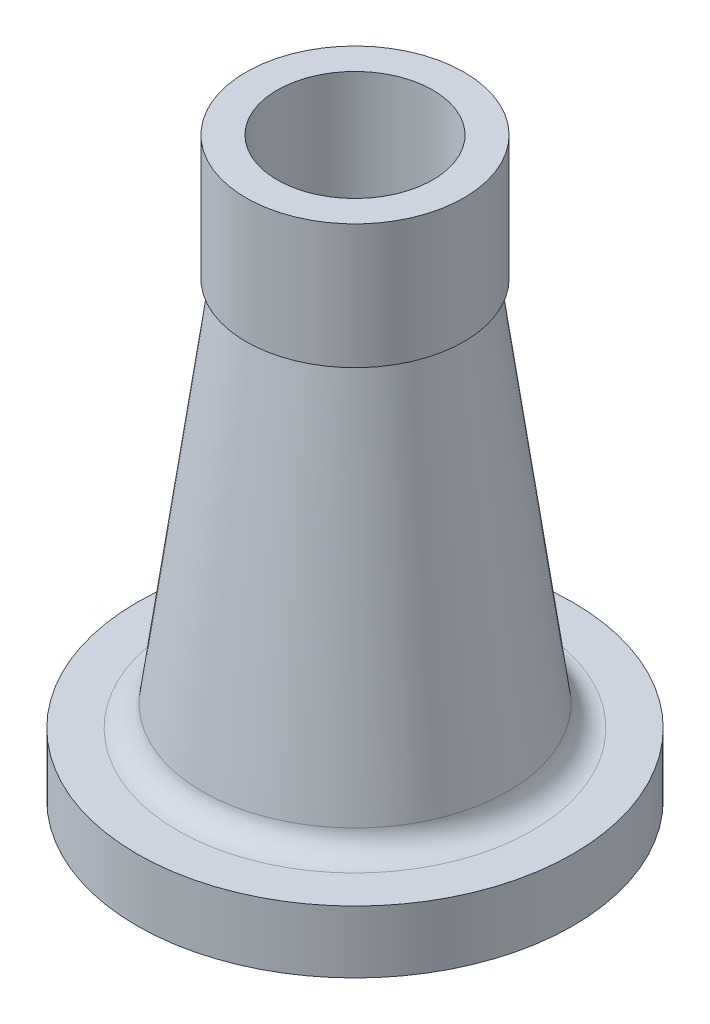
ISO-10303-21;
HEADER;
FILE_DESCRIPTION(('STEP AP214'),'2;1');
FILE_NAME('part.step','',(''),(''),'','','');
FILE_SCHEMA(('AUTOMOTIVE_DESIGN { 1 0 10303 214 1 1 1 1 }'));
ENDSEC;
DATA;
#1=APPLICATION_CONTEXT('core data for automotive mechanical design processes');
#2=APPLICATION_PROTOCOL_DEFINITION('international standard','automotive_design',2000,#1);
#3=PRODUCT_CONTEXT('',#1,'mechanical');
#4=PRODUCT('Part','Part','',(#3));
#5=PRODUCT_RELATED_PRODUCT_CATEGORY('part','',(#4));
#6=PRODUCT_DEFINITION_FORMATION('','',#4);
#7=PRODUCT_DEFINITION_CONTEXT('part definition',#1,'design');
#8=PRODUCT_DEFINITION('design','',#6,#7);
#9=PRODUCT_DEFINITION_SHAPE('','',#8);
#10=(LENGTH_UNIT() NAMED_UNIT(*) SI_UNIT(.MILLI.,.METRE.));
#11=(NAMED_UNIT(*) PLANE_ANGLE_UNIT() SI_UNIT($,.RADIAN.));
#12=(NAMED_UNIT(*) SI_UNIT($,.STERADIAN.) SOLID_ANGLE_UNIT());
#13=UNCERTAINTY_MEASURE_WITH_UNIT(LENGTH_MEASURE(1.E-05),#10,'distance_accuracy_value','');
#14=(GEOMETRIC_REPRESENTATION_CONTEXT(3) GLOBAL_UNCERTAINTY_ASSIGNED_CONTEXT((#13)) GLOBAL_UNIT_ASSIGNED_CONTEXT((#10,
#11,#12)) REPRESENTATION_CONTEXT('',''));
#15=CARTESIAN_POINT('',(0.,0.,0.));
#16=DIRECTION('',(0.,0.,1.));
#17=DIRECTION('',(1.,0.,0.));
#18=AXIS2_PLACEMENT_3D('',#15,#16,#17);
#19=CARTESIAN_POINT('',(0.,0.,0.));
#20=DIRECTION('',(0.,-1.,0.));
#21=DIRECTION('',(0.,0.,-1.));
#22=AXIS2_PLACEMENT_3D('',#19,#20,#21);
#23=CYLINDRICAL_SURFACE('',#22,50.);
#24=CARTESIAN_POINT('',(0.,0.,0.));
#25=DIRECTION('',(0.,-1.,0.));
#26=DIRECTION('',(0.,0.,-1.));
#27=AXIS2_PLACEMENT_3D('',#24,#25,#26);
#28=CIRCLE('',#27,50.);
#29=CARTESIAN_POINT('',(0.,0.,-50.));
#30=VERTEX_POINT('',#29);
#31=EDGE_CURVE('E42',#30,#30,#28,.T.);
#32=ORIENTED_EDGE('',*,*,#31,.T.);
#33=EDGE_LOOP('',(#32));
#34=FACE_BOUND('',#33,.T.);
#35=CARTESIAN_POINT('',(0.,3.,0.));
#36=DIRECTION('',(0.,-1.,0.));
#37=DIRECTION('',(0.,0.,-1.));
#38=AXIS2_PLACEMENT_3D('',#35,#36,#37);
#39=CIRCLE('',#38,50.);
#40=CARTESIAN_POINT('',(0.,3.,-50.));
#41=VERTEX_POINT('',#40);
#42=EDGE_CURVE('E72',#41,#41,#39,.T.);
#43=ORIENTED_EDGE('',*,*,#42,.F.);
#44=EDGE_LOOP('',(#43));
#45=FACE_BOUND('',#44,.T.);
#46=ADVANCED_FACE('F31',(#34,#45),#23,.F.);
#47=CARTESIAN_POINT('',(50.,0.,0.));
#48=DIRECTION('',(0.,-1.,0.));
#49=DIRECTION('',(0.,0.,-1.));
#50=AXIS2_PLACEMENT_3D('',#47,#48,#49);
#51=PLANE('',#50);
#52=CARTESIAN_POINT('',(0.,0.,0.));
#53=DIRECTION('',(0.,-1.,0.));
#54=DIRECTION('',(0.,0.,-1.));
#55=AXIS2_PLACEMENT_3D('',#52,#53,#54);
#56=CIRCLE('',#55,70.);
#57=CARTESIAN_POINT('',(0.,0.,-70.));
#58=VERTEX_POINT('',#57);
#59=EDGE_CURVE('E46',#58,#58,#56,.T.);
#60=ORIENTED_EDGE('',*,*,#59,.T.);
#61=EDGE_LOOP('',(#60));
#62=FACE_BOUND('',#61,.T.);
#63=ORIENTED_EDGE('',*,*,#31,.F.);
#64=EDGE_LOOP('',(#63));
#65=FACE_BOUND('',#64,.T.);
#66=ADVANCED_FACE('F80',(#62,#65),#51,.T.);
#67=CARTESIAN_POINT('',(0.,0.,0.));
#68=DIRECTION('',(0.,-1.,0.));
#69=DIRECTION('',(0.,0.,-1.));
#70=AXIS2_PLACEMENT_3D('',#67,#68,#69);
#71=CYLINDRICAL_SURFACE('',#70,70.);
#72=CARTESIAN_POINT('',(0.,20.,0.));
#73=DIRECTION('',(0.,-1.,0.));
#74=DIRECTION('',(0.,0.,-1.));
#75=AXIS2_PLACEMENT_3D('',#72,#73,#74);
#76=CIRCLE('',#75,70.);
#77=CARTESIAN_POINT('',(0.,20.,-70.));
#78=VERTEX_POINT('',#77);
#79=EDGE_CURVE('E51',#78,#78,#76,.T.);
#80=ORIENTED_EDGE('',*,*,#79,.T.);
#81=EDGE_LOOP('',(#80));
#82=FACE_BOUND('',#81,.T.);
#83=ORIENTED_EDGE('',*,*,#59,.F.);
#84=EDGE_LOOP('',(#83));
#85=FACE_BOUND('',#84,.T.);
#86=ADVANCED_FACE('F85',(#82,#85),#71,.T.);
#87=CARTESIAN_POINT('',(70.,20.,0.));
#88=DIRECTION('',(0.,1.,0.));
#89=DIRECTION('',(0.,0.,1.));
#90=AXIS2_PLACEMENT_3D('',#87,#88,#89);
#91=PLANE('',#90);
#92=CARTESIAN_POINT('',(0.,20.,0.));
#93=DIRECTION('',(0.,1.,0.));
#94=DIRECTION('',(0.,0.,1.));
#95=AXIS2_PLACEMENT_3D('',#92,#93,#94);
#96=CIRCLE('',#95,56.9856450256374);
#97=CARTESIAN_POINT('',(0.,20.,56.9856450256374));
#98=VERTEX_POINT('',#97);
#99=EDGE_CURVE('E38',#98,#98,#96,.F.);
#100=ORIENTED_EDGE('',*,*,#99,.T.);
#101=EDGE_LOOP('',(#100));
#102=FACE_BOUND('',#101,.T.);
#103=ORIENTED_EDGE('',*,*,#79,.F.);
#104=EDGE_LOOP('',(#103));
#105=FACE_BOUND('',#104,.T.);
#106=ADVANCED_FACE('F91',(#102,#105),#91,.T.);
#107=CARTESIAN_POINT('',(0.,20.,0.));
#108=DIRECTION('',(0.,-1.,0.));
#109=DIRECTION('',(0.,0.,-1.));
#110=AXIS2_PLACEMENT_3D('',#107,#108,#109);
#111=CONICAL_SURFACE('',#110,50.,0.135170698649009);
#112=CARTESIAN_POINT('',(0.,26.9219243634863,0.));
#113=DIRECTION('',(0.,-1.,0.));
#114=DIRECTION('',(0.,0.,-1.));
#115=AXIS2_PLACEMENT_3D('',#112,#113,#114);
#116=CIRCLE('',#115,49.0586182865659);
#117=CARTESIAN_POINT('',(0.,26.9219243634863,-49.0586182865659));
#118=VERTEX_POINT('',#117);
#119=EDGE_CURVE('E10',#118,#118,#116,.F.);
#120=ORIENTED_EDGE('',*,*,#119,.T.);
#121=EDGE_LOOP('',(#120));
#122=FACE_BOUND('',#121,.T.);
#123=CARTESIAN_POINT('',(0.,145.,0.));
#124=DIRECTION('',(0.,-1.,0.));
#125=DIRECTION('',(0.,0.,-1.));
#126=AXIS2_PLACEMENT_3D('',#123,#124,#125);
#127=CIRCLE('',#126,33.);
#128=CARTESIAN_POINT('',(0.,145.,-33.));
#129=VERTEX_POINT('',#128);
#130=EDGE_CURVE('E54',#129,#129,#127,.T.);
#131=ORIENTED_EDGE('',*,*,#130,.T.);
#132=EDGE_LOOP('',(#131));
#133=FACE_BOUND('',#132,.T.);
#134=ADVANCED_FACE('F95',(#122,#133),#111,.T.);
#135=CARTESIAN_POINT('',(33.,145.,0.));
#136=DIRECTION('',(0.,-1.,0.));
#137=DIRECTION('',(0.,0.,-1.));
#138=AXIS2_PLACEMENT_3D('',#135,#136,#137);
#139=PLANE('',#138);
#140=CARTESIAN_POINT('',(0.,145.,0.));
#141=DIRECTION('',(0.,-1.,0.));
#142=DIRECTION('',(0.,0.,-1.));
#143=AXIS2_PLACEMENT_3D('',#140,#141,#142);
#144=CIRCLE('',#143,35.);
#145=CARTESIAN_POINT('',(0.,145.,-35.));
#146=VERTEX_POINT('',#145);
#147=EDGE_CURVE('E57',#146,#146,#144,.T.);
#148=ORIENTED_EDGE('',*,*,#147,.T.);
#149=EDGE_LOOP('',(#148));
#150=FACE_BOUND('',#149,.T.);
#151=ORIENTED_EDGE('',*,*,#130,.F.);
#152=EDGE_LOOP('',(#151));
#153=FACE_BOUND('',#152,.T.);
#154=ADVANCED_FACE('F98',(#150,#153),#139,.T.);
#155=CARTESIAN_POINT('',(0.,0.,0.));
#156=DIRECTION('',(0.,-1.,0.));
#157=DIRECTION('',(0.,0.,-1.));
#158=AXIS2_PLACEMENT_3D('',#155,#156,#157);
#159=CYLINDRICAL_SURFACE('',#158,35.);
#160=CARTESIAN_POINT('',(0.,185.,0.));
#161=DIRECTION('',(0.,-1.,0.));
#162=DIRECTION('',(0.,0.,-1.));
#163=AXIS2_PLACEMENT_3D('',#160,#161,#162);
#164=CIRCLE('',#163,35.);
#165=CARTESIAN_POINT('',(0.,185.,-35.));
#166=VERTEX_POINT('',#165);
#167=EDGE_CURVE('E60',#166,#166,#164,.T.);
#168=ORIENTED_EDGE('',*,*,#167,.T.);
#169=EDGE_LOOP('',(#168));
#170=FACE_BOUND('',#169,.T.);
#171=ORIENTED_EDGE('',*,*,#147,.F.);
#172=EDGE_LOOP('',(#171));
#173=FACE_BOUND('',#172,.T.);
#174=ADVANCED_FACE('F101',(#170,#173),#159,.T.);
#175=CARTESIAN_POINT('',(35.,185.,0.));
#176=DIRECTION('',(0.,1.,0.));
#177=DIRECTION('',(0.,0.,1.));
#178=AXIS2_PLACEMENT_3D('',#175,#176,#177);
#179=PLANE('',#178);
#180=CARTESIAN_POINT('',(0.,185.,0.));
#181=DIRECTION('',(0.,-1.,0.));
#182=DIRECTION('',(0.,0.,-1.));
#183=AXIS2_PLACEMENT_3D('',#180,#181,#182);
#184=CIRCLE('',#183,25.);
#185=CARTESIAN_POINT('',(0.,185.,-25.));
#186=VERTEX_POINT('',#185);
#187=EDGE_CURVE('E63',#186,#186,#184,.T.);
#188=ORIENTED_EDGE('',*,*,#187,.T.);
#189=EDGE_LOOP('',(#188));
#190=FACE_BOUND('',#189,.T.);
#191=ORIENTED_EDGE('',*,*,#167,.F.);
#192=EDGE_LOOP('',(#191));
#193=FACE_BOUND('',#192,.T.);
#194=ADVANCED_FACE('F105',(#190,#193),#179,.T.);
#195=CARTESIAN_POINT('',(0.,0.,0.));
#196=DIRECTION('',(0.,-1.,0.));
#197=DIRECTION('',(0.,0.,-1.));
#198=AXIS2_PLACEMENT_3D('',#195,#196,#197);
#199=CYLINDRICAL_SURFACE('',#198,25.);
#200=CARTESIAN_POINT('',(0.,129.617233220244,0.));
#201=DIRECTION('',(0.,-1.,0.));
#202=DIRECTION('',(0.,0.,-1.));
#203=AXIS2_PLACEMENT_3D('',#200,#201,#202);
#204=CIRCLE('',#203,25.);
#205=CARTESIAN_POINT('',(0.,129.617233220244,-25.));
#206=VERTEX_POINT('',#205);
#207=EDGE_CURVE('E66',#206,#206,#204,.T.);
#208=ORIENTED_EDGE('',*,*,#207,.T.);
#209=EDGE_LOOP('',(#208));
#210=FACE_BOUND('',#209,.T.);
#211=ORIENTED_EDGE('',*,*,#187,.F.);
#212=EDGE_LOOP('',(#211));
#213=FACE_BOUND('',#212,.T.);
#214=ADVANCED_FACE('F109',(#210,#213),#199,.F.);
#215=CARTESIAN_POINT('',(0.,129.617233220244,0.));
#216=DIRECTION('',(0.,-1.,0.));
#217=DIRECTION('',(0.,0.,-1.));
#218=AXIS2_PLACEMENT_3D('',#215,#216,#217);
#219=CONICAL_SURFACE('',#218,25.,0.135170698649009);
#220=CARTESIAN_POINT('',(0.,3.,0.));
#221=DIRECTION('',(0.,-1.,0.));
#222=DIRECTION('',(0.,0.,-1.));
#223=AXIS2_PLACEMENT_3D('',#220,#221,#222);
#224=CIRCLE('',#223,42.2199437179532);
#225=CARTESIAN_POINT('',(0.,3.,-42.2199437179532));
#226=VERTEX_POINT('',#225);
#227=EDGE_CURVE('E69',#226,#226,#224,.T.);
#228=ORIENTED_EDGE('',*,*,#227,.T.);
#229=EDGE_LOOP('',(#228));
#230=FACE_BOUND('',#229,.T.);
#231=ORIENTED_EDGE('',*,*,#207,.F.);
#232=EDGE_LOOP('',(#231));
#233=FACE_BOUND('',#232,.T.);
#234=ADVANCED_FACE('F113',(#230,#233),#219,.F.);
#235=CARTESIAN_POINT('',(42.2199437179532,3.,0.));
#236=DIRECTION('',(0.,-1.,0.));
#237=DIRECTION('',(0.,0.,-1.));
#238=AXIS2_PLACEMENT_3D('',#235,#236,#237);
#239=PLANE('',#238);
#240=ORIENTED_EDGE('',*,*,#42,.T.);
#241=EDGE_LOOP('',(#240));
#242=FACE_BOUND('',#241,.T.);
#243=ORIENTED_EDGE('',*,*,#227,.F.);
#244=EDGE_LOOP('',(#243));
#245=FACE_BOUND('',#244,.T.);
#246=ADVANCED_FACE('F76',(#242,#245),#239,.T.);
#247=CARTESIAN_POINT('',(0.,28.,0.));
#248=DIRECTION('',(0.,1.,0.));
#249=DIRECTION('',(0.,0.,1.));
#250=AXIS2_PLACEMENT_3D('',#247,#248,#249);
#251=TOROIDAL_SURFACE('',#250,56.9856450256374,8.);
#252=ORIENTED_EDGE('',*,*,#119,.F.);
#253=EDGE_LOOP('',(#252));
#254=FACE_BOUND('',#253,.T.);
#255=ORIENTED_EDGE('',*,*,#99,.F.);
#256=EDGE_LOOP('',(#255));
#257=FACE_BOUND('',#256,.T.);
#258=ADVANCED_FACE('F33',(#254,#257),#251,.F.);
#259=CLOSED_SHELL('',(#46,#66,#86,#106,#134,#154,#174,#194,#214,#234,#246,#258));
#260=MANIFOLD_SOLID_BREP('B2',#259);
#261=ADVANCED_BREP_SHAPE_REPRESENTATION('',(#18,#260),#14);
#262=SHAPE_DEFINITION_REPRESENTATION(#9,#261);
ENDSEC;
END-ISO-10303-21;
